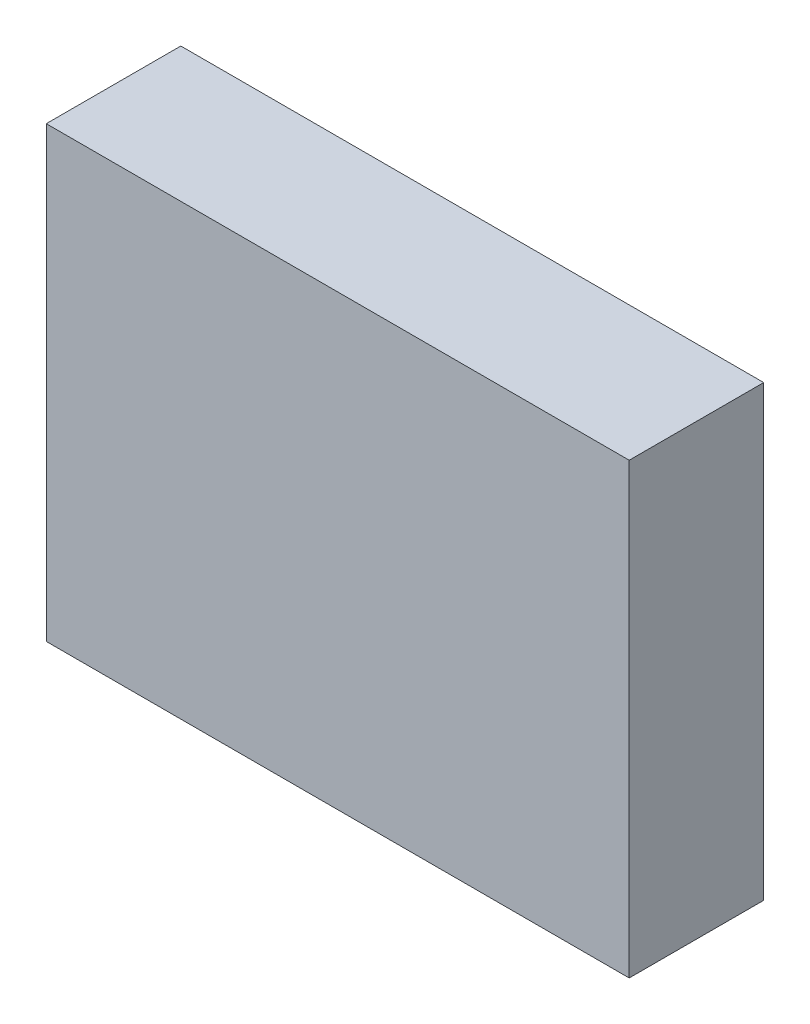
ISO-10303-21;
HEADER;
FILE_DESCRIPTION(('STEP AP214'),'2;1');
FILE_NAME('part.step','',(''),(''),'','','');
FILE_SCHEMA(('AUTOMOTIVE_DESIGN { 1 0 10303 214 1 1 1 1 }'));
ENDSEC;
DATA;
#1=APPLICATION_CONTEXT('core data for automotive mechanical design processes');
#2=APPLICATION_PROTOCOL_DEFINITION('international standard','automotive_design',2000,#1);
#3=PRODUCT_CONTEXT('',#1,'mechanical');
#4=PRODUCT('Part','Part','',(#3));
#5=PRODUCT_RELATED_PRODUCT_CATEGORY('part','',(#4));
#6=PRODUCT_DEFINITION_FORMATION('','',#4);
#7=PRODUCT_DEFINITION_CONTEXT('part definition',#1,'design');
#8=PRODUCT_DEFINITION('design','',#6,#7);
#9=PRODUCT_DEFINITION_SHAPE('','',#8);
#10=(LENGTH_UNIT() NAMED_UNIT(*) SI_UNIT(.MILLI.,.METRE.));
#11=(NAMED_UNIT(*) PLANE_ANGLE_UNIT() SI_UNIT($,.RADIAN.));
#12=(NAMED_UNIT(*) SI_UNIT($,.STERADIAN.) SOLID_ANGLE_UNIT());
#13=UNCERTAINTY_MEASURE_WITH_UNIT(LENGTH_MEASURE(1.E-05),#10,'distance_accuracy_value','');
#14=(GEOMETRIC_REPRESENTATION_CONTEXT(3) GLOBAL_UNCERTAINTY_ASSIGNED_CONTEXT((#13)) GLOBAL_UNIT_ASSIGNED_CONTEXT((#10,
#11,#12)) REPRESENTATION_CONTEXT('',''));
#15=CARTESIAN_POINT('',(0.,0.,0.));
#16=DIRECTION('',(0.,0.,1.));
#17=DIRECTION('',(1.,0.,0.));
#18=AXIS2_PLACEMENT_3D('',#15,#16,#17);
#19=CARTESIAN_POINT('',(65.,-50.,30.));
#20=DIRECTION('',(-1.,0.,0.));
#21=DIRECTION('',(0.,0.,1.));
#22=AXIS2_PLACEMENT_3D('',#19,#20,#21);
#23=PLANE('',#22);
#24=DIRECTION('',(0.,1.,0.));
#25=VECTOR('',#24,1.);
#26=CARTESIAN_POINT('',(65.,-50.,0.));
#27=LINE('',#26,#25);
#28=CARTESIAN_POINT('',(65.,-50.,0.));
#29=VERTEX_POINT('',#28);
#30=CARTESIAN_POINT('',(65.,50.,0.));
#31=VERTEX_POINT('',#30);
#32=EDGE_CURVE('E104',#29,#31,#27,.T.);
#33=ORIENTED_EDGE('',*,*,#32,.T.);
#34=DIRECTION('',(0.,0.,-1.));
#35=VECTOR('',#34,1.);
#36=CARTESIAN_POINT('',(65.,50.,30.));
#37=LINE('',#36,#35);
#38=CARTESIAN_POINT('',(65.,50.,30.));
#39=VERTEX_POINT('',#38);
#40=EDGE_CURVE('E11',#39,#31,#37,.T.);
#41=ORIENTED_EDGE('',*,*,#40,.F.);
#42=DIRECTION('',(0.,1.,0.));
#43=VECTOR('',#42,1.);
#44=CARTESIAN_POINT('',(65.,-50.,30.));
#45=LINE('',#44,#43);
#46=CARTESIAN_POINT('',(65.,-50.,30.));
#47=VERTEX_POINT('',#46);
#48=EDGE_CURVE('E92',#47,#39,#45,.T.);
#49=ORIENTED_EDGE('',*,*,#48,.F.);
#50=DIRECTION('',(0.,0.,-1.));
#51=VECTOR('',#50,1.);
#52=CARTESIAN_POINT('',(65.,-50.,30.));
#53=LINE('',#52,#51);
#54=EDGE_CURVE('E100',#47,#29,#53,.T.);
#55=ORIENTED_EDGE('',*,*,#54,.T.);
#56=EDGE_LOOP('',(#33,#41,#49,#55));
#57=FACE_BOUND('',#56,.T.);
#58=ADVANCED_FACE('F41',(#57),#23,.F.);
#59=CARTESIAN_POINT('',(-65.,50.,30.));
#60=DIRECTION('',(0.,-1.,0.));
#61=DIRECTION('',(0.,0.,-1.));
#62=AXIS2_PLACEMENT_3D('',#59,#60,#61);
#63=PLANE('',#62);
#64=DIRECTION('',(-1.,0.,0.));
#65=VECTOR('',#64,1.);
#66=CARTESIAN_POINT('',(-65.,50.,0.));
#67=LINE('',#66,#65);
#68=CARTESIAN_POINT('',(-65.,50.,0.));
#69=VERTEX_POINT('',#68);
#70=EDGE_CURVE('E96',#31,#69,#67,.T.);
#71=ORIENTED_EDGE('',*,*,#70,.T.);
#72=DIRECTION('',(0.,0.,-1.));
#73=VECTOR('',#72,1.);
#74=CARTESIAN_POINT('',(-65.,50.,30.));
#75=LINE('',#74,#73);
#76=CARTESIAN_POINT('',(-65.,50.,30.));
#77=VERTEX_POINT('',#76);
#78=EDGE_CURVE('E49',#77,#69,#75,.T.);
#79=ORIENTED_EDGE('',*,*,#78,.F.);
#80=DIRECTION('',(-1.,0.,0.));
#81=VECTOR('',#80,1.);
#82=CARTESIAN_POINT('',(-65.,50.,30.));
#83=LINE('',#82,#81);
#84=EDGE_CURVE('E87',#39,#77,#83,.T.);
#85=ORIENTED_EDGE('',*,*,#84,.F.);
#86=ORIENTED_EDGE('',*,*,#40,.T.);
#87=EDGE_LOOP('',(#71,#79,#85,#86));
#88=FACE_BOUND('',#87,.T.);
#89=ADVANCED_FACE('F95',(#88),#63,.F.);
#90=CARTESIAN_POINT('',(-65.,-50.,30.));
#91=DIRECTION('',(1.,0.,0.));
#92=DIRECTION('',(0.,0.,-1.));
#93=AXIS2_PLACEMENT_3D('',#90,#91,#92);
#94=PLANE('',#93);
#95=DIRECTION('',(0.,-1.,0.));
#96=VECTOR('',#95,1.);
#97=CARTESIAN_POINT('',(-65.,-50.,0.));
#98=LINE('',#97,#96);
#99=CARTESIAN_POINT('',(-65.,-50.,0.));
#100=VERTEX_POINT('',#99);
#101=EDGE_CURVE('E74',#69,#100,#98,.T.);
#102=ORIENTED_EDGE('',*,*,#101,.T.);
#103=DIRECTION('',(0.,0.,-1.));
#104=VECTOR('',#103,1.);
#105=CARTESIAN_POINT('',(-65.,-50.,30.));
#106=LINE('',#105,#104);
#107=CARTESIAN_POINT('',(-65.,-50.,30.));
#108=VERTEX_POINT('',#107);
#109=EDGE_CURVE('E97',#108,#100,#106,.T.);
#110=ORIENTED_EDGE('',*,*,#109,.F.);
#111=DIRECTION('',(0.,-1.,0.));
#112=VECTOR('',#111,1.);
#113=CARTESIAN_POINT('',(-65.,-50.,30.));
#114=LINE('',#113,#112);
#115=EDGE_CURVE('E90',#77,#108,#114,.T.);
#116=ORIENTED_EDGE('',*,*,#115,.F.);
#117=ORIENTED_EDGE('',*,*,#78,.T.);
#118=EDGE_LOOP('',(#102,#110,#116,#117));
#119=FACE_BOUND('',#118,.T.);
#120=ADVANCED_FACE('F98',(#119),#94,.F.);
#121=CARTESIAN_POINT('',(-65.,-50.,30.));
#122=DIRECTION('',(0.,1.,0.));
#123=DIRECTION('',(0.,0.,1.));
#124=AXIS2_PLACEMENT_3D('',#121,#122,#123);
#125=PLANE('',#124);
#126=DIRECTION('',(1.,0.,0.));
#127=VECTOR('',#126,1.);
#128=CARTESIAN_POINT('',(-65.,-50.,0.));
#129=LINE('',#128,#127);
#130=EDGE_CURVE('E80',#100,#29,#129,.T.);
#131=ORIENTED_EDGE('',*,*,#130,.T.);
#132=ORIENTED_EDGE('',*,*,#54,.F.);
#133=DIRECTION('',(1.,0.,0.));
#134=VECTOR('',#133,1.);
#135=CARTESIAN_POINT('',(-65.,-50.,30.));
#136=LINE('',#135,#134);
#137=EDGE_CURVE('E57',#108,#47,#136,.T.);
#138=ORIENTED_EDGE('',*,*,#137,.F.);
#139=ORIENTED_EDGE('',*,*,#109,.T.);
#140=EDGE_LOOP('',(#131,#132,#138,#139));
#141=FACE_BOUND('',#140,.T.);
#142=ADVANCED_FACE('F111',(#141),#125,.F.);
#143=CARTESIAN_POINT('',(0.,0.,30.));
#144=DIRECTION('',(0.,0.,-1.));
#145=DIRECTION('',(-1.,0.,0.));
#146=AXIS2_PLACEMENT_3D('',#143,#144,#145);
#147=PLANE('',#146);
#148=ORIENTED_EDGE('',*,*,#48,.T.);
#149=ORIENTED_EDGE('',*,*,#84,.T.);
#150=ORIENTED_EDGE('',*,*,#115,.T.);
#151=ORIENTED_EDGE('',*,*,#137,.T.);
#152=EDGE_LOOP('',(#148,#149,#150,#151));
#153=FACE_BOUND('',#152,.T.);
#154=ADVANCED_FACE('F88',(#153),#147,.F.);
#155=CARTESIAN_POINT('',(0.,0.,0.));
#156=DIRECTION('',(0.,0.,-1.));
#157=DIRECTION('',(-1.,0.,0.));
#158=AXIS2_PLACEMENT_3D('',#155,#156,#157);
#159=PLANE('',#158);
#160=ORIENTED_EDGE('',*,*,#32,.F.);
#161=ORIENTED_EDGE('',*,*,#130,.F.);
#162=ORIENTED_EDGE('',*,*,#101,.F.);
#163=ORIENTED_EDGE('',*,*,#70,.F.);
#164=EDGE_LOOP('',(#160,#161,#162,#163));
#165=FACE_BOUND('',#164,.T.);
#166=ADVANCED_FACE('F114',(#165),#159,.T.);
#167=CLOSED_SHELL('',(#58,#89,#120,#142,#154,#166));
#168=MANIFOLD_SOLID_BREP('B2',#167);
#169=ADVANCED_BREP_SHAPE_REPRESENTATION('',(#18,#168),#14);
#170=SHAPE_DEFINITION_REPRESENTATION(#9,#169);
ENDSEC;
END-ISO-10303-21;
